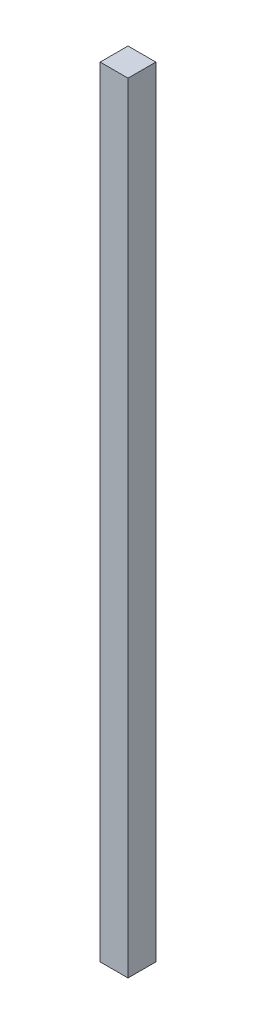
ISO-10303-21;
HEADER;
FILE_DESCRIPTION(('STEP AP214'),'2;1');
FILE_NAME('part.step','',(''),(''),'','','');
FILE_SCHEMA(('AUTOMOTIVE_DESIGN { 1 0 10303 214 1 1 1 1 }'));
ENDSEC;
DATA;
#1=APPLICATION_CONTEXT('core data for automotive mechanical design processes');
#2=APPLICATION_PROTOCOL_DEFINITION('international standard','automotive_design',2000,#1);
#3=PRODUCT_CONTEXT('',#1,'mechanical');
#4=PRODUCT('Part','Part','',(#3));
#5=PRODUCT_RELATED_PRODUCT_CATEGORY('part','',(#4));
#6=PRODUCT_DEFINITION_FORMATION('','',#4);
#7=PRODUCT_DEFINITION_CONTEXT('part definition',#1,'design');
#8=PRODUCT_DEFINITION('design','',#6,#7);
#9=PRODUCT_DEFINITION_SHAPE('','',#8);
#10=(LENGTH_UNIT() NAMED_UNIT(*) SI_UNIT(.MILLI.,.METRE.));
#11=(NAMED_UNIT(*) PLANE_ANGLE_UNIT() SI_UNIT($,.RADIAN.));
#12=(NAMED_UNIT(*) SI_UNIT($,.STERADIAN.) SOLID_ANGLE_UNIT());
#13=UNCERTAINTY_MEASURE_WITH_UNIT(LENGTH_MEASURE(1.E-05),#10,'distance_accuracy_value','');
#14=(GEOMETRIC_REPRESENTATION_CONTEXT(3) GLOBAL_UNCERTAINTY_ASSIGNED_CONTEXT((#13)) GLOBAL_UNIT_ASSIGNED_CONTEXT((#10,
#11,#12)) REPRESENTATION_CONTEXT('',''));
#15=CARTESIAN_POINT('',(0.,0.,0.));
#16=DIRECTION('',(0.,0.,1.));
#17=DIRECTION('',(1.,0.,0.));
#18=AXIS2_PLACEMENT_3D('',#15,#16,#17);
#19=CARTESIAN_POINT('',(-7.5,420.,-7.5));
#20=DIRECTION('',(1.,0.,0.));
#21=DIRECTION('',(0.,0.,-1.));
#22=AXIS2_PLACEMENT_3D('',#19,#20,#21);
#23=PLANE('',#22);
#24=DIRECTION('',(0.,0.,1.));
#25=VECTOR('',#24,1.);
#26=CARTESIAN_POINT('',(-7.5,0.,-7.5));
#27=LINE('',#26,#25);
#28=CARTESIAN_POINT('',(-7.5,0.,-7.5));
#29=VERTEX_POINT('',#28);
#30=CARTESIAN_POINT('',(-7.5,0.,7.5));
#31=VERTEX_POINT('',#30);
#32=EDGE_CURVE('E95',#29,#31,#27,.T.);
#33=ORIENTED_EDGE('',*,*,#32,.T.);
#34=DIRECTION('',(0.,-1.,0.));
#35=VECTOR('',#34,1.);
#36=CARTESIAN_POINT('',(-7.5,420.,7.5));
#37=LINE('',#36,#35);
#38=CARTESIAN_POINT('',(-7.5,420.,7.5));
#39=VERTEX_POINT('',#38);
#40=EDGE_CURVE('E11',#39,#31,#37,.T.);
#41=ORIENTED_EDGE('',*,*,#40,.F.);
#42=DIRECTION('',(0.,0.,1.));
#43=VECTOR('',#42,1.);
#44=CARTESIAN_POINT('',(-7.5,420.,-7.5));
#45=LINE('',#44,#43);
#46=CARTESIAN_POINT('',(-7.5,420.,-7.5));
#47=VERTEX_POINT('',#46);
#48=EDGE_CURVE('E83',#47,#39,#45,.T.);
#49=ORIENTED_EDGE('',*,*,#48,.F.);
#50=DIRECTION('',(0.,-1.,0.));
#51=VECTOR('',#50,1.);
#52=CARTESIAN_POINT('',(-7.5,420.,-7.5));
#53=LINE('',#52,#51);
#54=EDGE_CURVE('E91',#47,#29,#53,.T.);
#55=ORIENTED_EDGE('',*,*,#54,.T.);
#56=EDGE_LOOP('',(#33,#41,#49,#55));
#57=FACE_BOUND('',#56,.T.);
#58=ADVANCED_FACE('F32',(#57),#23,.F.);
#59=CARTESIAN_POINT('',(7.5,420.,7.5));
#60=DIRECTION('',(0.,0.,-1.));
#61=DIRECTION('',(-1.,0.,0.));
#62=AXIS2_PLACEMENT_3D('',#59,#60,#61);
#63=PLANE('',#62);
#64=DIRECTION('',(1.,0.,0.));
#65=VECTOR('',#64,1.);
#66=CARTESIAN_POINT('',(7.5,0.,7.5));
#67=LINE('',#66,#65);
#68=CARTESIAN_POINT('',(7.5,0.,7.5));
#69=VERTEX_POINT('',#68);
#70=EDGE_CURVE('E87',#31,#69,#67,.T.);
#71=ORIENTED_EDGE('',*,*,#70,.T.);
#72=DIRECTION('',(0.,-1.,0.));
#73=VECTOR('',#72,1.);
#74=CARTESIAN_POINT('',(7.5,420.,7.5));
#75=LINE('',#74,#73);
#76=CARTESIAN_POINT('',(7.5,420.,7.5));
#77=VERTEX_POINT('',#76);
#78=EDGE_CURVE('E40',#77,#69,#75,.T.);
#79=ORIENTED_EDGE('',*,*,#78,.F.);
#80=DIRECTION('',(1.,0.,0.));
#81=VECTOR('',#80,1.);
#82=CARTESIAN_POINT('',(7.5,420.,7.5));
#83=LINE('',#82,#81);
#84=EDGE_CURVE('E78',#39,#77,#83,.T.);
#85=ORIENTED_EDGE('',*,*,#84,.F.);
#86=ORIENTED_EDGE('',*,*,#40,.T.);
#87=EDGE_LOOP('',(#71,#79,#85,#86));
#88=FACE_BOUND('',#87,.T.);
#89=ADVANCED_FACE('F86',(#88),#63,.F.);
#90=CARTESIAN_POINT('',(7.5,420.,-7.5));
#91=DIRECTION('',(-1.,0.,0.));
#92=DIRECTION('',(0.,0.,1.));
#93=AXIS2_PLACEMENT_3D('',#90,#91,#92);
#94=PLANE('',#93);
#95=DIRECTION('',(0.,0.,-1.));
#96=VECTOR('',#95,1.);
#97=CARTESIAN_POINT('',(7.5,0.,-7.5));
#98=LINE('',#97,#96);
#99=CARTESIAN_POINT('',(7.5,0.,-7.5));
#100=VERTEX_POINT('',#99);
#101=EDGE_CURVE('E65',#69,#100,#98,.T.);
#102=ORIENTED_EDGE('',*,*,#101,.T.);
#103=DIRECTION('',(0.,-1.,0.));
#104=VECTOR('',#103,1.);
#105=CARTESIAN_POINT('',(7.5,420.,-7.5));
#106=LINE('',#105,#104);
#107=CARTESIAN_POINT('',(7.5,420.,-7.5));
#108=VERTEX_POINT('',#107);
#109=EDGE_CURVE('E88',#108,#100,#106,.T.);
#110=ORIENTED_EDGE('',*,*,#109,.F.);
#111=DIRECTION('',(0.,0.,-1.));
#112=VECTOR('',#111,1.);
#113=CARTESIAN_POINT('',(7.5,420.,-7.5));
#114=LINE('',#113,#112);
#115=EDGE_CURVE('E81',#77,#108,#114,.T.);
#116=ORIENTED_EDGE('',*,*,#115,.F.);
#117=ORIENTED_EDGE('',*,*,#78,.T.);
#118=EDGE_LOOP('',(#102,#110,#116,#117));
#119=FACE_BOUND('',#118,.T.);
#120=ADVANCED_FACE('F89',(#119),#94,.F.);
#121=CARTESIAN_POINT('',(7.5,420.,-7.5));
#122=DIRECTION('',(0.,0.,1.));
#123=DIRECTION('',(1.,0.,0.));
#124=AXIS2_PLACEMENT_3D('',#121,#122,#123);
#125=PLANE('',#124);
#126=DIRECTION('',(-1.,0.,0.));
#127=VECTOR('',#126,1.);
#128=CARTESIAN_POINT('',(7.5,0.,-7.5));
#129=LINE('',#128,#127);
#130=EDGE_CURVE('E71',#100,#29,#129,.T.);
#131=ORIENTED_EDGE('',*,*,#130,.T.);
#132=ORIENTED_EDGE('',*,*,#54,.F.);
#133=DIRECTION('',(-1.,0.,0.));
#134=VECTOR('',#133,1.);
#135=CARTESIAN_POINT('',(7.5,420.,-7.5));
#136=LINE('',#135,#134);
#137=EDGE_CURVE('E48',#108,#47,#136,.T.);
#138=ORIENTED_EDGE('',*,*,#137,.F.);
#139=ORIENTED_EDGE('',*,*,#109,.T.);
#140=EDGE_LOOP('',(#131,#132,#138,#139));
#141=FACE_BOUND('',#140,.T.);
#142=ADVANCED_FACE('F102',(#141),#125,.F.);
#143=CARTESIAN_POINT('',(0.,420.,0.));
#144=DIRECTION('',(0.,-1.,0.));
#145=DIRECTION('',(0.,0.,-1.));
#146=AXIS2_PLACEMENT_3D('',#143,#144,#145);
#147=PLANE('',#146);
#148=ORIENTED_EDGE('',*,*,#48,.T.);
#149=ORIENTED_EDGE('',*,*,#84,.T.);
#150=ORIENTED_EDGE('',*,*,#115,.T.);
#151=ORIENTED_EDGE('',*,*,#137,.T.);
#152=EDGE_LOOP('',(#148,#149,#150,#151));
#153=FACE_BOUND('',#152,.T.);
#154=ADVANCED_FACE('F79',(#153),#147,.F.);
#155=CARTESIAN_POINT('',(0.,0.,0.));
#156=DIRECTION('',(0.,-1.,0.));
#157=DIRECTION('',(0.,0.,-1.));
#158=AXIS2_PLACEMENT_3D('',#155,#156,#157);
#159=PLANE('',#158);
#160=ORIENTED_EDGE('',*,*,#32,.F.);
#161=ORIENTED_EDGE('',*,*,#130,.F.);
#162=ORIENTED_EDGE('',*,*,#101,.F.);
#163=ORIENTED_EDGE('',*,*,#70,.F.);
#164=EDGE_LOOP('',(#160,#161,#162,#163));
#165=FACE_BOUND('',#164,.T.);
#166=ADVANCED_FACE('F105',(#165),#159,.T.);
#167=CLOSED_SHELL('',(#58,#89,#120,#142,#154,#166));
#168=MANIFOLD_SOLID_BREP('B2',#167);
#169=ADVANCED_BREP_SHAPE_REPRESENTATION('',(#18,#168),#14);
#170=SHAPE_DEFINITION_REPRESENTATION(#9,#169);
ENDSEC;
END-ISO-10303-21;
